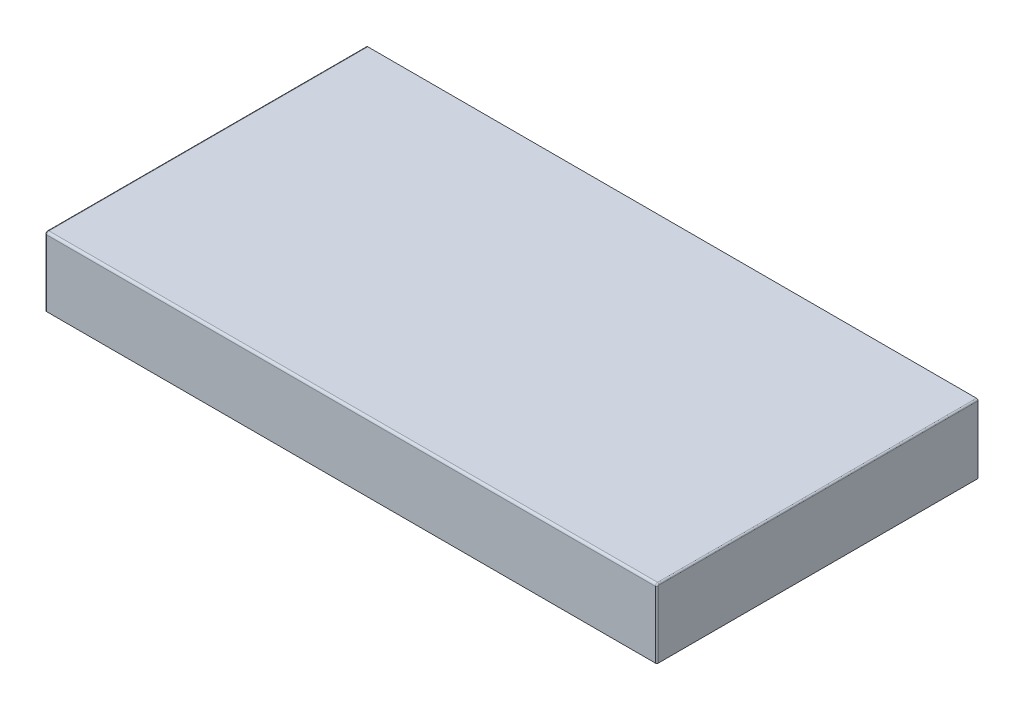
ISO-10303-21;
HEADER;
FILE_DESCRIPTION(('STEP AP214'),'2;1');
FILE_NAME('part.step','',(''),(''),'','','');
FILE_SCHEMA(('AUTOMOTIVE_DESIGN { 1 0 10303 214 1 1 1 1 }'));
ENDSEC;
DATA;
#1=APPLICATION_CONTEXT('core data for automotive mechanical design processes');
#2=APPLICATION_PROTOCOL_DEFINITION('international standard','automotive_design',2000,#1);
#3=PRODUCT_CONTEXT('',#1,'mechanical');
#4=PRODUCT('Part','Part','',(#3));
#5=PRODUCT_RELATED_PRODUCT_CATEGORY('part','',(#4));
#6=PRODUCT_DEFINITION_FORMATION('','',#4);
#7=PRODUCT_DEFINITION_CONTEXT('part definition',#1,'design');
#8=PRODUCT_DEFINITION('design','',#6,#7);
#9=PRODUCT_DEFINITION_SHAPE('','',#8);
#10=(LENGTH_UNIT() NAMED_UNIT(*) SI_UNIT(.MILLI.,.METRE.));
#11=(NAMED_UNIT(*) PLANE_ANGLE_UNIT() SI_UNIT($,.RADIAN.));
#12=(NAMED_UNIT(*) SI_UNIT($,.STERADIAN.) SOLID_ANGLE_UNIT());
#13=UNCERTAINTY_MEASURE_WITH_UNIT(LENGTH_MEASURE(1.E-05),#10,'distance_accuracy_value','');
#14=(GEOMETRIC_REPRESENTATION_CONTEXT(3) GLOBAL_UNCERTAINTY_ASSIGNED_CONTEXT((#13)) GLOBAL_UNIT_ASSIGNED_CONTEXT((#10,
#11,#12)) REPRESENTATION_CONTEXT('',''));
#15=CARTESIAN_POINT('',(0.,0.,0.));
#16=DIRECTION('',(0.,0.,1.));
#17=DIRECTION('',(1.,0.,0.));
#18=AXIS2_PLACEMENT_3D('',#15,#16,#17);
#19=CARTESIAN_POINT('',(400.,45.,210.));
#20=DIRECTION('',(-1.,0.,0.));
#21=DIRECTION('',(0.,0.,1.));
#22=AXIS2_PLACEMENT_3D('',#19,#20,#21);
#23=PLANE('',#22);
#24=DIRECTION('',(0.,1.,0.));
#25=VECTOR('',#24,1.);
#26=CARTESIAN_POINT('',(400.,45.,-210.));
#27=LINE('',#26,#25);
#28=CARTESIAN_POINT('',(400.,-45.,-210.));
#29=VERTEX_POINT('',#28);
#30=CARTESIAN_POINT('',(400.,43.,-210.));
#31=VERTEX_POINT('',#30);
#32=EDGE_CURVE('E130',#29,#31,#27,.T.);
#33=ORIENTED_EDGE('',*,*,#32,.T.);
#34=DIRECTION('',(0.,0.,-1.));
#35=VECTOR('',#34,1.);
#36=CARTESIAN_POINT('',(400.,43.,210.));
#37=LINE('',#36,#35);
#38=CARTESIAN_POINT('',(400.,43.,207.));
#39=VERTEX_POINT('',#38);
#40=EDGE_CURVE('E159',#31,#39,#37,.F.);
#41=ORIENTED_EDGE('',*,*,#40,.T.);
#42=CARTESIAN_POINT('',(400.,42.,207.));
#43=DIRECTION('',(-1.,0.,0.));
#44=DIRECTION('',(0.,0.,1.));
#45=AXIS2_PLACEMENT_3D('',#42,#43,#44);
#46=CIRCLE('',#45,1.);
#47=CARTESIAN_POINT('',(400.,42.,208.));
#48=VERTEX_POINT('',#47);
#49=EDGE_CURVE('E157',#39,#48,#46,.F.);
#50=ORIENTED_EDGE('',*,*,#49,.T.);
#51=DIRECTION('',(0.,1.,0.));
#52=VECTOR('',#51,1.);
#53=CARTESIAN_POINT('',(400.,-45.,208.));
#54=LINE('',#53,#52);
#55=CARTESIAN_POINT('',(400.,-45.,208.));
#56=VERTEX_POINT('',#55);
#57=EDGE_CURVE('E155',#48,#56,#54,.F.);
#58=ORIENTED_EDGE('',*,*,#57,.T.);
#59=DIRECTION('',(0.,0.,-1.));
#60=VECTOR('',#59,1.);
#61=CARTESIAN_POINT('',(400.,-45.,210.));
#62=LINE('',#61,#60);
#63=EDGE_CURVE('E117',#56,#29,#62,.T.);
#64=ORIENTED_EDGE('',*,*,#63,.T.);
#65=EDGE_LOOP('',(#33,#41,#50,#58,#64));
#66=FACE_BOUND('',#65,.T.);
#67=ADVANCED_FACE('F35',(#66),#23,.F.);
#68=CARTESIAN_POINT('',(-400.,45.,210.));
#69=DIRECTION('',(0.,-1.,0.));
#70=DIRECTION('',(0.,0.,-1.));
#71=AXIS2_PLACEMENT_3D('',#68,#69,#70);
#72=PLANE('',#71);
#73=DIRECTION('',(-1.,0.,0.));
#74=VECTOR('',#73,1.);
#75=CARTESIAN_POINT('',(-400.,45.,-210.));
#76=LINE('',#75,#74);
#77=CARTESIAN_POINT('',(398.,45.,-210.));
#78=VERTEX_POINT('',#77);
#79=CARTESIAN_POINT('',(-398.,45.,-210.));
#80=VERTEX_POINT('',#79);
#81=EDGE_CURVE('E126',#78,#80,#76,.T.);
#82=ORIENTED_EDGE('',*,*,#81,.T.);
#83=DIRECTION('',(0.,0.,-1.));
#84=VECTOR('',#83,1.);
#85=CARTESIAN_POINT('',(-398.,45.,210.));
#86=LINE('',#85,#84);
#87=CARTESIAN_POINT('',(-398.,45.,207.));
#88=VERTEX_POINT('',#87);
#89=EDGE_CURVE('E153',#80,#88,#86,.F.);
#90=ORIENTED_EDGE('',*,*,#89,.T.);
#91=DIRECTION('',(-1.,0.,0.));
#92=VECTOR('',#91,1.);
#93=CARTESIAN_POINT('',(400.,45.,207.));
#94=LINE('',#93,#92);
#95=CARTESIAN_POINT('',(398.,45.,207.));
#96=VERTEX_POINT('',#95);
#97=EDGE_CURVE('E138',#88,#96,#94,.F.);
#98=ORIENTED_EDGE('',*,*,#97,.T.);
#99=DIRECTION('',(0.,0.,-1.));
#100=VECTOR('',#99,1.);
#101=CARTESIAN_POINT('',(398.,45.,210.));
#102=LINE('',#101,#100);
#103=EDGE_CURVE('E150',#96,#78,#102,.T.);
#104=ORIENTED_EDGE('',*,*,#103,.T.);
#105=EDGE_LOOP('',(#82,#90,#98,#104));
#106=FACE_BOUND('',#105,.T.);
#107=ADVANCED_FACE('F194',(#106),#72,.F.);
#108=CARTESIAN_POINT('',(-400.,45.,210.));
#109=DIRECTION('',(1.,0.,0.));
#110=DIRECTION('',(0.,0.,-1.));
#111=AXIS2_PLACEMENT_3D('',#108,#109,#110);
#112=PLANE('',#111);
#113=CARTESIAN_POINT('',(-400.,42.,207.));
#114=DIRECTION('',(1.,0.,0.));
#115=DIRECTION('',(0.,0.,-1.));
#116=AXIS2_PLACEMENT_3D('',#113,#114,#115);
#117=CIRCLE('',#116,1.);
#118=CARTESIAN_POINT('',(-400.,42.,208.));
#119=VERTEX_POINT('',#118);
#120=CARTESIAN_POINT('',(-400.,43.,207.));
#121=VERTEX_POINT('',#120);
#122=EDGE_CURVE('E143',#119,#121,#117,.F.);
#123=ORIENTED_EDGE('',*,*,#122,.T.);
#124=DIRECTION('',(0.,0.,-1.));
#125=VECTOR('',#124,1.);
#126=CARTESIAN_POINT('',(-400.,43.,210.));
#127=LINE('',#126,#125);
#128=CARTESIAN_POINT('',(-400.,43.,-210.));
#129=VERTEX_POINT('',#128);
#130=EDGE_CURVE('E124',#121,#129,#127,.T.);
#131=ORIENTED_EDGE('',*,*,#130,.T.);
#132=DIRECTION('',(0.,-1.,0.));
#133=VECTOR('',#132,1.);
#134=CARTESIAN_POINT('',(-400.,45.,-210.));
#135=LINE('',#134,#133);
#136=CARTESIAN_POINT('',(-400.,-45.,-210.));
#137=VERTEX_POINT('',#136);
#138=EDGE_CURVE('E121',#129,#137,#135,.T.);
#139=ORIENTED_EDGE('',*,*,#138,.T.);
#140=DIRECTION('',(0.,0.,-1.));
#141=VECTOR('',#140,1.);
#142=CARTESIAN_POINT('',(-400.,-45.,210.));
#143=LINE('',#142,#141);
#144=CARTESIAN_POINT('',(-400.,-45.,208.));
#145=VERTEX_POINT('',#144);
#146=EDGE_CURVE('E107',#145,#137,#143,.T.);
#147=ORIENTED_EDGE('',*,*,#146,.F.);
#148=DIRECTION('',(0.,-1.,0.));
#149=VECTOR('',#148,1.);
#150=CARTESIAN_POINT('',(-400.,42.,208.));
#151=LINE('',#150,#149);
#152=EDGE_CURVE('E141',#145,#119,#151,.F.);
#153=ORIENTED_EDGE('',*,*,#152,.T.);
#154=EDGE_LOOP('',(#123,#131,#139,#147,#153));
#155=FACE_BOUND('',#154,.T.);
#156=ADVANCED_FACE('F122',(#155),#112,.F.);
#157=CARTESIAN_POINT('',(-400.,-45.,210.));
#158=DIRECTION('',(0.,1.,0.));
#159=DIRECTION('',(0.,0.,1.));
#160=AXIS2_PLACEMENT_3D('',#157,#158,#159);
#161=PLANE('',#160);
#162=DIRECTION('',(1.,0.,0.));
#163=VECTOR('',#162,1.);
#164=CARTESIAN_POINT('',(-400.,-45.,210.));
#165=LINE('',#164,#163);
#166=CARTESIAN_POINT('',(-398.,-45.,210.));
#167=VERTEX_POINT('',#166);
#168=CARTESIAN_POINT('',(398.,-45.,210.));
#169=VERTEX_POINT('',#168);
#170=EDGE_CURVE('E131',#167,#169,#165,.T.);
#171=ORIENTED_EDGE('',*,*,#170,.F.);
#172=CARTESIAN_POINT('',(-398.,-45.,208.));
#173=DIRECTION('',(0.,1.,0.));
#174=DIRECTION('',(0.,0.,1.));
#175=AXIS2_PLACEMENT_3D('',#172,#173,#174);
#176=CIRCLE('',#175,2.);
#177=EDGE_CURVE('E11',#167,#145,#176,.F.);
#178=ORIENTED_EDGE('',*,*,#177,.T.);
#179=ORIENTED_EDGE('',*,*,#146,.T.);
#180=DIRECTION('',(1.,0.,0.));
#181=VECTOR('',#180,1.);
#182=CARTESIAN_POINT('',(-400.,-45.,-210.));
#183=LINE('',#182,#181);
#184=EDGE_CURVE('E111',#137,#29,#183,.T.);
#185=ORIENTED_EDGE('',*,*,#184,.T.);
#186=ORIENTED_EDGE('',*,*,#63,.F.);
#187=CARTESIAN_POINT('',(398.,-45.,208.));
#188=DIRECTION('',(0.,1.,0.));
#189=DIRECTION('',(0.,0.,1.));
#190=AXIS2_PLACEMENT_3D('',#187,#188,#189);
#191=CIRCLE('',#190,2.);
#192=EDGE_CURVE('E44',#56,#169,#191,.F.);
#193=ORIENTED_EDGE('',*,*,#192,.T.);
#194=EDGE_LOOP('',(#171,#178,#179,#185,#186,#193));
#195=FACE_BOUND('',#194,.T.);
#196=ADVANCED_FACE('F109',(#195),#161,.F.);
#197=CARTESIAN_POINT('',(0.,0.,210.));
#198=DIRECTION('',(0.,0.,1.));
#199=DIRECTION('',(1.,0.,0.));
#200=AXIS2_PLACEMENT_3D('',#197,#198,#199);
#201=PLANE('',#200);
#202=DIRECTION('',(-1.,0.,0.));
#203=VECTOR('',#202,1.);
#204=CARTESIAN_POINT('',(-400.,42.,210.));
#205=LINE('',#204,#203);
#206=CARTESIAN_POINT('',(398.,42.,210.));
#207=VERTEX_POINT('',#206);
#208=CARTESIAN_POINT('',(-398.,42.,210.));
#209=VERTEX_POINT('',#208);
#210=EDGE_CURVE('E116',#207,#209,#205,.T.);
#211=ORIENTED_EDGE('',*,*,#210,.T.);
#212=DIRECTION('',(0.,-1.,0.));
#213=VECTOR('',#212,1.);
#214=CARTESIAN_POINT('',(-398.,-45.,210.));
#215=LINE('',#214,#213);
#216=EDGE_CURVE('E58',#209,#167,#215,.T.);
#217=ORIENTED_EDGE('',*,*,#216,.T.);
#218=ORIENTED_EDGE('',*,*,#170,.T.);
#219=DIRECTION('',(0.,1.,0.));
#220=VECTOR('',#219,1.);
#221=CARTESIAN_POINT('',(398.,42.,210.));
#222=LINE('',#221,#220);
#223=EDGE_CURVE('E165',#169,#207,#222,.T.);
#224=ORIENTED_EDGE('',*,*,#223,.T.);
#225=EDGE_LOOP('',(#211,#217,#218,#224));
#226=FACE_BOUND('',#225,.T.);
#227=ADVANCED_FACE('F279',(#226),#201,.T.);
#228=CARTESIAN_POINT('',(0.,0.,-210.));
#229=DIRECTION('',(0.,0.,1.));
#230=DIRECTION('',(1.,0.,0.));
#231=AXIS2_PLACEMENT_3D('',#228,#229,#230);
#232=PLANE('',#231);
#233=ORIENTED_EDGE('',*,*,#138,.F.);
#234=CARTESIAN_POINT('',(-398.,43.,-210.));
#235=DIRECTION('',(0.,0.,1.));
#236=DIRECTION('',(1.,0.,0.));
#237=AXIS2_PLACEMENT_3D('',#234,#235,#236);
#238=CIRCLE('',#237,2.);
#239=EDGE_CURVE('E148',#129,#80,#238,.F.);
#240=ORIENTED_EDGE('',*,*,#239,.T.);
#241=ORIENTED_EDGE('',*,*,#81,.F.);
#242=CARTESIAN_POINT('',(398.,43.,-210.));
#243=DIRECTION('',(0.,0.,1.));
#244=DIRECTION('',(1.,0.,0.));
#245=AXIS2_PLACEMENT_3D('',#242,#243,#244);
#246=CIRCLE('',#245,2.);
#247=EDGE_CURVE('E146',#78,#31,#246,.F.);
#248=ORIENTED_EDGE('',*,*,#247,.T.);
#249=ORIENTED_EDGE('',*,*,#32,.F.);
#250=ORIENTED_EDGE('',*,*,#184,.F.);
#251=EDGE_LOOP('',(#233,#240,#241,#248,#249,#250));
#252=FACE_BOUND('',#251,.T.);
#253=ADVANCED_FACE('F128',(#252),#232,.F.);
#254=CARTESIAN_POINT('',(0.,42.,207.));
#255=DIRECTION('',(1.,0.,0.));
#256=DIRECTION('',(0.,0.,-1.));
#257=AXIS2_PLACEMENT_3D('',#254,#255,#256);
#258=CYLINDRICAL_SURFACE('',#257,3.);
#259=ORIENTED_EDGE('',*,*,#97,.F.);
#260=CARTESIAN_POINT('',(-398.,42.,207.));
#261=DIRECTION('',(1.,0.,0.));
#262=DIRECTION('',(0.,0.,-1.));
#263=AXIS2_PLACEMENT_3D('',#260,#261,#262);
#264=CIRCLE('',#263,3.);
#265=EDGE_CURVE('E163',#88,#209,#264,.T.);
#266=ORIENTED_EDGE('',*,*,#265,.T.);
#267=ORIENTED_EDGE('',*,*,#210,.F.);
#268=CARTESIAN_POINT('',(398.,42.,207.));
#269=DIRECTION('',(-1.,0.,0.));
#270=DIRECTION('',(0.,0.,1.));
#271=AXIS2_PLACEMENT_3D('',#268,#269,#270);
#272=CIRCLE('',#271,3.);
#273=EDGE_CURVE('E161',#207,#96,#272,.T.);
#274=ORIENTED_EDGE('',*,*,#273,.T.);
#275=EDGE_LOOP('',(#259,#266,#267,#274));
#276=FACE_BOUND('',#275,.T.);
#277=ADVANCED_FACE('F203',(#276),#258,.T.);
#278=CARTESIAN_POINT('',(-398.,0.,208.));
#279=DIRECTION('',(0.,1.,0.));
#280=DIRECTION('',(0.,0.,1.));
#281=AXIS2_PLACEMENT_3D('',#278,#279,#280);
#282=CYLINDRICAL_SURFACE('',#281,2.);
#283=ORIENTED_EDGE('',*,*,#177,.F.);
#284=ORIENTED_EDGE('',*,*,#216,.F.);
#285=CARTESIAN_POINT('',(-398.,42.,208.));
#286=DIRECTION('',(0.,1.,0.));
#287=DIRECTION('',(0.,0.,1.));
#288=AXIS2_PLACEMENT_3D('',#285,#286,#287);
#289=CIRCLE('',#288,2.);
#290=EDGE_CURVE('E172',#119,#209,#289,.T.);
#291=ORIENTED_EDGE('',*,*,#290,.F.);
#292=ORIENTED_EDGE('',*,*,#152,.F.);
#293=EDGE_LOOP('',(#283,#284,#291,#292));
#294=FACE_BOUND('',#293,.T.);
#295=ADVANCED_FACE('F210',(#294),#282,.T.);
#296=CARTESIAN_POINT('',(-398.,42.,207.));
#297=DIRECTION('',(1.,0.,0.));
#298=DIRECTION('',(0.,0.,-1.));
#299=AXIS2_PLACEMENT_3D('',#296,#297,#298);
#300=DEGENERATE_TOROIDAL_SURFACE('',#299,1.,2.,.T.);
#301=ORIENTED_EDGE('',*,*,#290,.T.);
#302=ORIENTED_EDGE('',*,*,#265,.F.);
#303=CARTESIAN_POINT('',(-398.,43.,207.));
#304=DIRECTION('',(0.,0.,-1.));
#305=DIRECTION('',(-1.,0.,0.));
#306=AXIS2_PLACEMENT_3D('',#303,#304,#305);
#307=CIRCLE('',#306,2.);
#308=EDGE_CURVE('E169',#121,#88,#307,.T.);
#309=ORIENTED_EDGE('',*,*,#308,.F.);
#310=ORIENTED_EDGE('',*,*,#122,.F.);
#311=EDGE_LOOP('',(#301,#302,#309,#310));
#312=FACE_BOUND('',#311,.T.);
#313=ADVANCED_FACE('F206',(#312),#300,.T.);
#314=CARTESIAN_POINT('',(-398.,43.,210.));
#315=DIRECTION('',(0.,0.,-1.));
#316=DIRECTION('',(-1.,0.,0.));
#317=AXIS2_PLACEMENT_3D('',#314,#315,#316);
#318=CYLINDRICAL_SURFACE('',#317,2.);
#319=ORIENTED_EDGE('',*,*,#308,.T.);
#320=ORIENTED_EDGE('',*,*,#89,.F.);
#321=ORIENTED_EDGE('',*,*,#239,.F.);
#322=ORIENTED_EDGE('',*,*,#130,.F.);
#323=EDGE_LOOP('',(#319,#320,#321,#322));
#324=FACE_BOUND('',#323,.T.);
#325=ADVANCED_FACE('F199',(#324),#318,.T.);
#326=CARTESIAN_POINT('',(398.,0.,208.));
#327=DIRECTION('',(0.,-1.,0.));
#328=DIRECTION('',(0.,0.,-1.));
#329=AXIS2_PLACEMENT_3D('',#326,#327,#328);
#330=CYLINDRICAL_SURFACE('',#329,2.);
#331=ORIENTED_EDGE('',*,*,#192,.F.);
#332=ORIENTED_EDGE('',*,*,#57,.F.);
#333=CARTESIAN_POINT('',(398.,42.,208.));
#334=DIRECTION('',(0.,1.,0.));
#335=DIRECTION('',(0.,0.,1.));
#336=AXIS2_PLACEMENT_3D('',#333,#334,#335);
#337=CIRCLE('',#336,2.);
#338=EDGE_CURVE('E39',#207,#48,#337,.T.);
#339=ORIENTED_EDGE('',*,*,#338,.F.);
#340=ORIENTED_EDGE('',*,*,#223,.F.);
#341=EDGE_LOOP('',(#331,#332,#339,#340));
#342=FACE_BOUND('',#341,.T.);
#343=ADVANCED_FACE('F37',(#342),#330,.T.);
#344=CARTESIAN_POINT('',(398.,42.,207.));
#345=DIRECTION('',(-1.,0.,0.));
#346=DIRECTION('',(0.,0.,1.));
#347=AXIS2_PLACEMENT_3D('',#344,#345,#346);
#348=DEGENERATE_TOROIDAL_SURFACE('',#347,1.,2.,.T.);
#349=ORIENTED_EDGE('',*,*,#338,.T.);
#350=ORIENTED_EDGE('',*,*,#49,.F.);
#351=CARTESIAN_POINT('',(398.,43.,207.));
#352=DIRECTION('',(0.,0.,-1.));
#353=DIRECTION('',(-1.,0.,0.));
#354=AXIS2_PLACEMENT_3D('',#351,#352,#353);
#355=CIRCLE('',#354,2.);
#356=EDGE_CURVE('E174',#96,#39,#355,.T.);
#357=ORIENTED_EDGE('',*,*,#356,.F.);
#358=ORIENTED_EDGE('',*,*,#273,.F.);
#359=EDGE_LOOP('',(#349,#350,#357,#358));
#360=FACE_BOUND('',#359,.T.);
#361=ADVANCED_FACE('F185',(#360),#348,.T.);
#362=CARTESIAN_POINT('',(398.,43.,210.));
#363=DIRECTION('',(0.,0.,-1.));
#364=DIRECTION('',(-1.,0.,0.));
#365=AXIS2_PLACEMENT_3D('',#362,#363,#364);
#366=CYLINDRICAL_SURFACE('',#365,2.);
#367=ORIENTED_EDGE('',*,*,#356,.T.);
#368=ORIENTED_EDGE('',*,*,#40,.F.);
#369=ORIENTED_EDGE('',*,*,#247,.F.);
#370=ORIENTED_EDGE('',*,*,#103,.F.);
#371=EDGE_LOOP('',(#367,#368,#369,#370));
#372=FACE_BOUND('',#371,.T.);
#373=ADVANCED_FACE('F190',(#372),#366,.T.);
#374=CLOSED_SHELL('',(#67,#107,#156,#196,#227,#253,#277,#295,#313,#325,#343,#361,#373));
#375=MANIFOLD_SOLID_BREP('B2',#374);
#376=ADVANCED_BREP_SHAPE_REPRESENTATION('',(#18,#375),#14);
#377=SHAPE_DEFINITION_REPRESENTATION(#9,#376);
ENDSEC;
END-ISO-10303-21;
